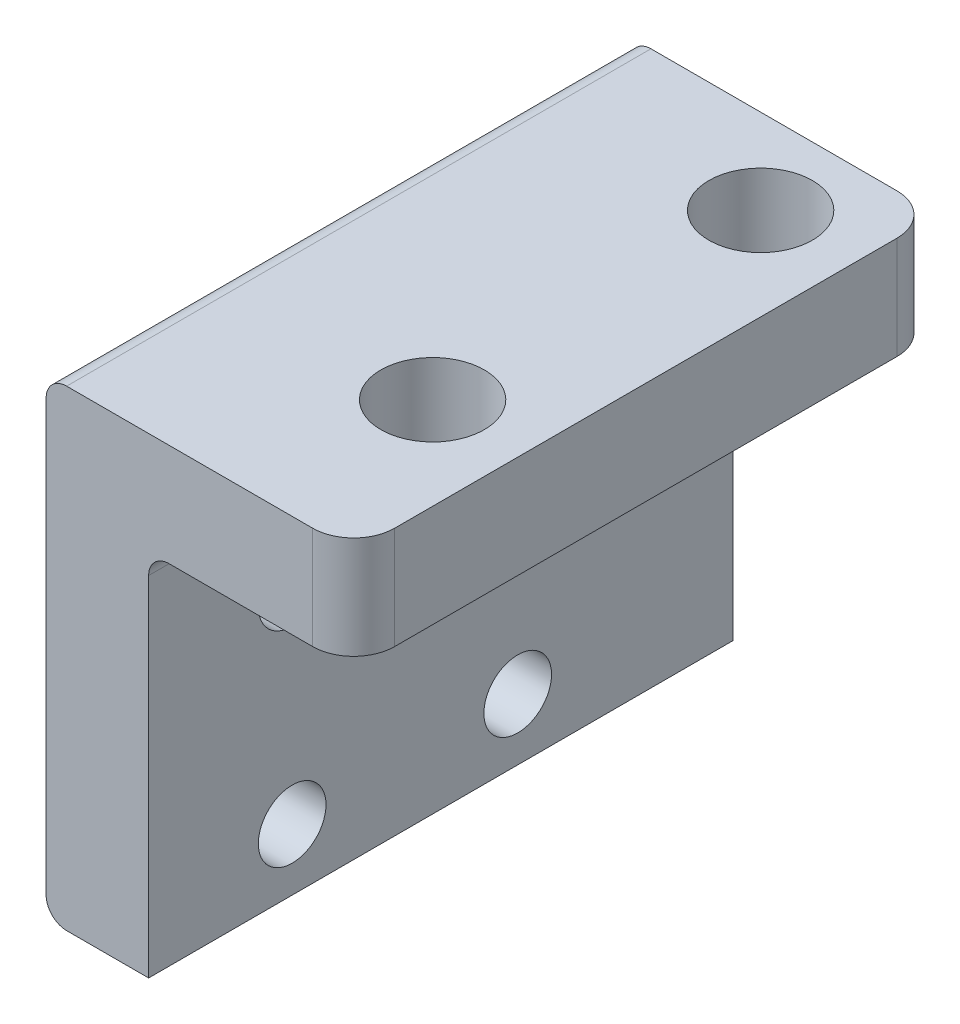
ISO-10303-21;
HEADER;
FILE_DESCRIPTION(('STEP AP214'),'2;1');
FILE_NAME('part.step','',(''),(''),'','','');
FILE_SCHEMA(('AUTOMOTIVE_DESIGN { 1 0 10303 214 1 1 1 1 }'));
ENDSEC;
DATA;
#1=APPLICATION_CONTEXT('core data for automotive mechanical design processes');
#2=APPLICATION_PROTOCOL_DEFINITION('international standard','automotive_design',2000,#1);
#3=PRODUCT_CONTEXT('',#1,'mechanical');
#4=PRODUCT('Part','Part','',(#3));
#5=PRODUCT_RELATED_PRODUCT_CATEGORY('part','',(#4));
#6=PRODUCT_DEFINITION_FORMATION('','',#4);
#7=PRODUCT_DEFINITION_CONTEXT('part definition',#1,'design');
#8=PRODUCT_DEFINITION('design','',#6,#7);
#9=PRODUCT_DEFINITION_SHAPE('','',#8);
#10=(LENGTH_UNIT() NAMED_UNIT(*) SI_UNIT(.MILLI.,.METRE.));
#11=(NAMED_UNIT(*) PLANE_ANGLE_UNIT() SI_UNIT($,.RADIAN.));
#12=(NAMED_UNIT(*) SI_UNIT($,.STERADIAN.) SOLID_ANGLE_UNIT());
#13=UNCERTAINTY_MEASURE_WITH_UNIT(LENGTH_MEASURE(1.E-05),#10,'distance_accuracy_value','');
#14=(GEOMETRIC_REPRESENTATION_CONTEXT(3) GLOBAL_UNCERTAINTY_ASSIGNED_CONTEXT((#13)) GLOBAL_UNIT_ASSIGNED_CONTEXT((#10,
#11,#12)) REPRESENTATION_CONTEXT('',''));
#15=CARTESIAN_POINT('',(0.,0.,0.));
#16=DIRECTION('',(0.,0.,1.));
#17=DIRECTION('',(1.,0.,0.));
#18=AXIS2_PLACEMENT_3D('',#15,#16,#17);
#19=CARTESIAN_POINT('',(0.,-18.,28.5));
#20=DIRECTION('',(-1.,0.,0.));
#21=DIRECTION('',(0.,-1.,0.));
#22=AXIS2_PLACEMENT_3D('',#19,#20,#21);
#23=PLANE('',#22);
#24=CARTESIAN_POINT('',(0.,-5.,21.5));
#25=DIRECTION('',(1.,0.,0.));
#26=DIRECTION('',(0.,0.,-1.));
#27=AXIS2_PLACEMENT_3D('',#24,#25,#26);
#28=CIRCLE('',#27,1.64999999999999);
#29=CARTESIAN_POINT('',(0.,-5.,19.85));
#30=VERTEX_POINT('',#29);
#31=EDGE_CURVE('E434',#30,#30,#28,.T.);
#32=ORIENTED_EDGE('',*,*,#31,.F.);
#33=EDGE_LOOP('',(#32));
#34=FACE_BOUND('',#33,.T.);
#35=CARTESIAN_POINT('',(0.,-15.,21.5));
#36=DIRECTION('',(1.,0.,0.));
#37=DIRECTION('',(0.,0.,-1.));
#38=AXIS2_PLACEMENT_3D('',#35,#36,#37);
#39=CIRCLE('',#38,1.64999999999999);
#40=CARTESIAN_POINT('',(0.,-15.,19.85));
#41=VERTEX_POINT('',#40);
#42=EDGE_CURVE('E440',#41,#41,#39,.T.);
#43=ORIENTED_EDGE('',*,*,#42,.F.);
#44=EDGE_LOOP('',(#43));
#45=FACE_BOUND('',#44,.T.);
#46=CARTESIAN_POINT('',(0.,-15.,10.5));
#47=DIRECTION('',(1.,0.,0.));
#48=DIRECTION('',(0.,0.,-1.));
#49=AXIS2_PLACEMENT_3D('',#46,#47,#48);
#50=CIRCLE('',#49,1.64999999999999);
#51=CARTESIAN_POINT('',(0.,-15.,8.85000000000002));
#52=VERTEX_POINT('',#51);
#53=EDGE_CURVE('E446',#52,#52,#50,.T.);
#54=ORIENTED_EDGE('',*,*,#53,.F.);
#55=EDGE_LOOP('',(#54));
#56=FACE_BOUND('',#55,.T.);
#57=CARTESIAN_POINT('',(0.,-5.,10.5));
#58=DIRECTION('',(1.,0.,0.));
#59=DIRECTION('',(0.,0.,-1.));
#60=AXIS2_PLACEMENT_3D('',#57,#58,#59);
#61=CIRCLE('',#60,1.64999999999999);
#62=CARTESIAN_POINT('',(0.,-5.,8.85000000000002));
#63=VERTEX_POINT('',#62);
#64=EDGE_CURVE('E451',#63,#63,#61,.T.);
#65=ORIENTED_EDGE('',*,*,#64,.F.);
#66=EDGE_LOOP('',(#65));
#67=FACE_BOUND('',#66,.T.);
#68=DIRECTION('',(0.,1.,0.));
#69=VECTOR('',#68,1.);
#70=CARTESIAN_POINT('',(0.,-18.,0.));
#71=LINE('',#70,#69);
#72=CARTESIAN_POINT('',(0.,-18.,0.));
#73=VERTEX_POINT('',#72);
#74=CARTESIAN_POINT('',(0.,-1.,0.));
#75=VERTEX_POINT('',#74);
#76=EDGE_CURVE('E160',#73,#75,#71,.T.);
#77=ORIENTED_EDGE('',*,*,#76,.T.);
#78=DIRECTION('',(0.,0.,-1.));
#79=VECTOR('',#78,1.);
#80=CARTESIAN_POINT('',(0.,-1.,28.5));
#81=LINE('',#80,#79);
#82=CARTESIAN_POINT('',(0.,-1.,28.5));
#83=VERTEX_POINT('',#82);
#84=EDGE_CURVE('E147',#75,#83,#81,.F.);
#85=ORIENTED_EDGE('',*,*,#84,.T.);
#86=DIRECTION('',(0.,1.,0.));
#87=VECTOR('',#86,1.);
#88=CARTESIAN_POINT('',(0.,-18.,28.5));
#89=LINE('',#88,#87);
#90=CARTESIAN_POINT('',(0.,-18.,28.5));
#91=VERTEX_POINT('',#90);
#92=EDGE_CURVE('E127',#91,#83,#89,.T.);
#93=ORIENTED_EDGE('',*,*,#92,.F.);
#94=DIRECTION('',(0.,0.,-1.));
#95=VECTOR('',#94,1.);
#96=CARTESIAN_POINT('',(0.,-18.,28.5));
#97=LINE('',#96,#95);
#98=EDGE_CURVE('E134',#91,#73,#97,.T.);
#99=ORIENTED_EDGE('',*,*,#98,.T.);
#100=EDGE_LOOP('',(#77,#85,#93,#99));
#101=FACE_BOUND('',#100,.T.);
#102=ADVANCED_FACE('F37',(#34,#45,#56,#67,#101),#23,.F.);
#103=CARTESIAN_POINT('',(0.,0.,28.5));
#104=DIRECTION('',(0.,1.,0.));
#105=DIRECTION('',(0.,0.,1.));
#106=AXIS2_PLACEMENT_3D('',#103,#104,#105);
#107=PLANE('',#106);
#108=CARTESIAN_POINT('',(5.5,0.,20.15));
#109=DIRECTION('',(0.,1.,0.));
#110=DIRECTION('',(0.,0.,1.));
#111=AXIS2_PLACEMENT_3D('',#108,#109,#110);
#112=CIRCLE('',#111,2.525);
#113=CARTESIAN_POINT('',(5.5,0.,22.675));
#114=VERTEX_POINT('',#113);
#115=EDGE_CURVE('E431',#114,#114,#112,.T.);
#116=ORIENTED_EDGE('',*,*,#115,.T.);
#117=EDGE_LOOP('',(#116));
#118=FACE_BOUND('',#117,.T.);
#119=CARTESIAN_POINT('',(5.5,0.,4.15));
#120=DIRECTION('',(0.,1.,0.));
#121=DIRECTION('',(0.,0.,1.));
#122=AXIS2_PLACEMENT_3D('',#119,#120,#121);
#123=CIRCLE('',#122,2.525);
#124=CARTESIAN_POINT('',(5.5,0.,6.675));
#125=VERTEX_POINT('',#124);
#126=EDGE_CURVE('E426',#125,#125,#123,.T.);
#127=ORIENTED_EDGE('',*,*,#126,.T.);
#128=EDGE_LOOP('',(#127));
#129=FACE_BOUND('',#128,.T.);
#130=DIRECTION('',(1.,0.,0.));
#131=VECTOR('',#130,1.);
#132=CARTESIAN_POINT('',(0.,0.,28.5));
#133=LINE('',#132,#131);
#134=CARTESIAN_POINT('',(1.,0.,28.5));
#135=VERTEX_POINT('',#134);
#136=CARTESIAN_POINT('',(8.,0.,28.5));
#137=VERTEX_POINT('',#136);
#138=EDGE_CURVE('E148',#135,#137,#133,.T.);
#139=ORIENTED_EDGE('',*,*,#138,.F.);
#140=DIRECTION('',(0.,0.,-1.));
#141=VECTOR('',#140,1.);
#142=CARTESIAN_POINT('',(1.,0.,0.));
#143=LINE('',#142,#141);
#144=CARTESIAN_POINT('',(1.,0.,0.));
#145=VERTEX_POINT('',#144);
#146=EDGE_CURVE('E192',#135,#145,#143,.T.);
#147=ORIENTED_EDGE('',*,*,#146,.T.);
#148=DIRECTION('',(1.,0.,0.));
#149=VECTOR('',#148,1.);
#150=CARTESIAN_POINT('',(0.,0.,0.));
#151=LINE('',#150,#149);
#152=CARTESIAN_POINT('',(8.,0.,0.));
#153=VERTEX_POINT('',#152);
#154=EDGE_CURVE('E162',#145,#153,#151,.T.);
#155=ORIENTED_EDGE('',*,*,#154,.T.);
#156=CARTESIAN_POINT('',(8.,0.,2.));
#157=DIRECTION('',(0.,1.,0.));
#158=DIRECTION('',(0.,0.,1.));
#159=AXIS2_PLACEMENT_3D('',#156,#157,#158);
#160=CIRCLE('',#159,2.);
#161=CARTESIAN_POINT('',(10.,0.,2.00000000000001));
#162=VERTEX_POINT('',#161);
#163=EDGE_CURVE('E187',#153,#162,#160,.F.);
#164=ORIENTED_EDGE('',*,*,#163,.T.);
#165=DIRECTION('',(0.,0.,-1.));
#166=VECTOR('',#165,1.);
#167=CARTESIAN_POINT('',(10.,0.,28.5));
#168=LINE('',#167,#166);
#169=CARTESIAN_POINT('',(10.,0.,26.5));
#170=VERTEX_POINT('',#169);
#171=EDGE_CURVE('E169',#170,#162,#168,.T.);
#172=ORIENTED_EDGE('',*,*,#171,.F.);
#173=CARTESIAN_POINT('',(8.,0.,26.5));
#174=DIRECTION('',(0.,1.,0.));
#175=DIRECTION('',(0.,0.,1.));
#176=AXIS2_PLACEMENT_3D('',#173,#174,#175);
#177=CIRCLE('',#176,2.);
#178=EDGE_CURVE('E184',#170,#137,#177,.F.);
#179=ORIENTED_EDGE('',*,*,#178,.T.);
#180=EDGE_LOOP('',(#139,#147,#155,#164,#172,#179));
#181=FACE_BOUND('',#180,.T.);
#182=ADVANCED_FACE('F217',(#118,#129,#181),#107,.F.);
#183=CARTESIAN_POINT('',(10.,0.,28.5));
#184=DIRECTION('',(-1.,0.,0.));
#185=DIRECTION('',(0.,-1.,0.));
#186=AXIS2_PLACEMENT_3D('',#183,#184,#185);
#187=PLANE('',#186);
#188=ORIENTED_EDGE('',*,*,#171,.T.);
#189=DIRECTION('',(0.,1.,0.));
#190=VECTOR('',#189,1.);
#191=CARTESIAN_POINT('',(10.,5.,2.));
#192=LINE('',#191,#190);
#193=CARTESIAN_POINT('',(10.,5.,2.00000000000001));
#194=VERTEX_POINT('',#193);
#195=EDGE_CURVE('E174',#162,#194,#192,.T.);
#196=ORIENTED_EDGE('',*,*,#195,.T.);
#197=DIRECTION('',(0.,0.,-1.));
#198=VECTOR('',#197,1.);
#199=CARTESIAN_POINT('',(10.,5.,28.5));
#200=LINE('',#199,#198);
#201=CARTESIAN_POINT('',(10.,5.,26.5));
#202=VERTEX_POINT('',#201);
#203=EDGE_CURVE('E144',#202,#194,#200,.T.);
#204=ORIENTED_EDGE('',*,*,#203,.F.);
#205=DIRECTION('',(0.,1.,0.));
#206=VECTOR('',#205,1.);
#207=CARTESIAN_POINT('',(10.,0.,26.5));
#208=LINE('',#207,#206);
#209=EDGE_CURVE('E172',#202,#170,#208,.F.);
#210=ORIENTED_EDGE('',*,*,#209,.T.);
#211=EDGE_LOOP('',(#188,#196,#204,#210));
#212=FACE_BOUND('',#211,.T.);
#213=ADVANCED_FACE('F228',(#212),#187,.F.);
#214=CARTESIAN_POINT('',(10.,5.,28.5));
#215=DIRECTION('',(0.,-1.,0.));
#216=DIRECTION('',(1.,0.,0.));
#217=AXIS2_PLACEMENT_3D('',#214,#215,#216);
#218=PLANE('',#217);
#219=CARTESIAN_POINT('',(5.5,5.,20.15));
#220=DIRECTION('',(0.,1.,0.));
#221=DIRECTION('',(-1.,0.,0.));
#222=AXIS2_PLACEMENT_3D('',#219,#220,#221);
#223=CIRCLE('',#222,2.525);
#224=CARTESIAN_POINT('',(2.97500000000001,5.,20.15));
#225=VERTEX_POINT('',#224);
#226=EDGE_CURVE('E422',#225,#225,#223,.T.);
#227=ORIENTED_EDGE('',*,*,#226,.F.);
#228=EDGE_LOOP('',(#227));
#229=FACE_BOUND('',#228,.T.);
#230=CARTESIAN_POINT('',(5.5,5.,4.15));
#231=DIRECTION('',(0.,1.,0.));
#232=DIRECTION('',(-1.,0.,0.));
#233=AXIS2_PLACEMENT_3D('',#230,#231,#232);
#234=CIRCLE('',#233,2.525);
#235=CARTESIAN_POINT('',(2.97500000000001,5.,4.15));
#236=VERTEX_POINT('',#235);
#237=EDGE_CURVE('E424',#236,#236,#234,.T.);
#238=ORIENTED_EDGE('',*,*,#237,.F.);
#239=EDGE_LOOP('',(#238));
#240=FACE_BOUND('',#239,.T.);
#241=DIRECTION('',(-1.,0.,0.));
#242=VECTOR('',#241,1.);
#243=CARTESIAN_POINT('',(10.,5.,0.));
#244=LINE('',#243,#242);
#245=CARTESIAN_POINT('',(8.,5.,0.));
#246=VERTEX_POINT('',#245);
#247=CARTESIAN_POINT('',(-3.99999999999999,5.,0.));
#248=VERTEX_POINT('',#247);
#249=EDGE_CURVE('E164',#246,#248,#244,.T.);
#250=ORIENTED_EDGE('',*,*,#249,.T.);
#251=DIRECTION('',(0.,0.,-1.));
#252=VECTOR('',#251,1.);
#253=CARTESIAN_POINT('',(-4.,5.,28.5));
#254=LINE('',#253,#252);
#255=CARTESIAN_POINT('',(-3.99999999999999,5.,28.5));
#256=VERTEX_POINT('',#255);
#257=EDGE_CURVE('E52',#248,#256,#254,.F.);
#258=ORIENTED_EDGE('',*,*,#257,.T.);
#259=DIRECTION('',(-1.,0.,0.));
#260=VECTOR('',#259,1.);
#261=CARTESIAN_POINT('',(10.,5.,28.5));
#262=LINE('',#261,#260);
#263=CARTESIAN_POINT('',(8.,5.,28.5));
#264=VERTEX_POINT('',#263);
#265=EDGE_CURVE('E150',#264,#256,#262,.T.);
#266=ORIENTED_EDGE('',*,*,#265,.F.);
#267=CARTESIAN_POINT('',(8.,5.,26.5));
#268=DIRECTION('',(0.,-1.,0.));
#269=DIRECTION('',(1.,0.,0.));
#270=AXIS2_PLACEMENT_3D('',#267,#268,#269);
#271=CIRCLE('',#270,2.);
#272=EDGE_CURVE('E177',#264,#202,#271,.F.);
#273=ORIENTED_EDGE('',*,*,#272,.T.);
#274=ORIENTED_EDGE('',*,*,#203,.T.);
#275=CARTESIAN_POINT('',(8.,5.,2.));
#276=DIRECTION('',(0.,-1.,0.));
#277=DIRECTION('',(1.,0.,0.));
#278=AXIS2_PLACEMENT_3D('',#275,#276,#277);
#279=CIRCLE('',#278,2.);
#280=EDGE_CURVE('E179',#194,#246,#279,.F.);
#281=ORIENTED_EDGE('',*,*,#280,.T.);
#282=EDGE_LOOP('',(#250,#258,#266,#273,#274,#281));
#283=FACE_BOUND('',#282,.T.);
#284=ADVANCED_FACE('F225',(#229,#240,#283),#218,.F.);
#285=CARTESIAN_POINT('',(-5.,5.,28.5));
#286=DIRECTION('',(1.,0.,0.));
#287=DIRECTION('',(0.,0.,-1.));
#288=AXIS2_PLACEMENT_3D('',#285,#286,#287);
#289=PLANE('',#288);
#290=CARTESIAN_POINT('',(-5.,-5.,21.5));
#291=DIRECTION('',(1.,0.,0.));
#292=DIRECTION('',(0.,0.,-1.));
#293=AXIS2_PLACEMENT_3D('',#290,#291,#292);
#294=CIRCLE('',#293,1.65);
#295=CARTESIAN_POINT('',(-5.,-5.,19.85));
#296=VERTEX_POINT('',#295);
#297=EDGE_CURVE('E437',#296,#296,#294,.T.);
#298=ORIENTED_EDGE('',*,*,#297,.T.);
#299=EDGE_LOOP('',(#298));
#300=FACE_BOUND('',#299,.T.);
#301=CARTESIAN_POINT('',(-5.,-15.,21.5));
#302=DIRECTION('',(1.,0.,0.));
#303=DIRECTION('',(0.,0.,-1.));
#304=AXIS2_PLACEMENT_3D('',#301,#302,#303);
#305=CIRCLE('',#304,1.65);
#306=CARTESIAN_POINT('',(-5.,-15.,19.85));
#307=VERTEX_POINT('',#306);
#308=EDGE_CURVE('E443',#307,#307,#305,.T.);
#309=ORIENTED_EDGE('',*,*,#308,.T.);
#310=EDGE_LOOP('',(#309));
#311=FACE_BOUND('',#310,.T.);
#312=CARTESIAN_POINT('',(-5.,-15.,10.5));
#313=DIRECTION('',(1.,0.,0.));
#314=DIRECTION('',(0.,0.,-1.));
#315=AXIS2_PLACEMENT_3D('',#312,#313,#314);
#316=CIRCLE('',#315,1.65);
#317=CARTESIAN_POINT('',(-5.,-15.,8.85000000000001));
#318=VERTEX_POINT('',#317);
#319=EDGE_CURVE('E449',#318,#318,#316,.T.);
#320=ORIENTED_EDGE('',*,*,#319,.T.);
#321=EDGE_LOOP('',(#320));
#322=FACE_BOUND('',#321,.T.);
#323=CARTESIAN_POINT('',(-5.,-5.,10.5));
#324=DIRECTION('',(1.,0.,0.));
#325=DIRECTION('',(0.,0.,-1.));
#326=AXIS2_PLACEMENT_3D('',#323,#324,#325);
#327=CIRCLE('',#326,1.65);
#328=CARTESIAN_POINT('',(-5.,-5.,8.85000000000001));
#329=VERTEX_POINT('',#328);
#330=EDGE_CURVE('E155',#329,#329,#327,.T.);
#331=ORIENTED_EDGE('',*,*,#330,.T.);
#332=EDGE_LOOP('',(#331));
#333=FACE_BOUND('',#332,.T.);
#334=DIRECTION('',(0.,-1.,0.));
#335=VECTOR('',#334,1.);
#336=CARTESIAN_POINT('',(-5.,5.,0.));
#337=LINE('',#336,#335);
#338=CARTESIAN_POINT('',(-5.,4.,0.));
#339=VERTEX_POINT('',#338);
#340=CARTESIAN_POINT('',(-5.,-17.,0.));
#341=VERTEX_POINT('',#340);
#342=EDGE_CURVE('E152',#339,#341,#337,.T.);
#343=ORIENTED_EDGE('',*,*,#342,.T.);
#344=DIRECTION('',(0.,0.,-1.));
#345=VECTOR('',#344,1.);
#346=CARTESIAN_POINT('',(-5.,-17.,28.5));
#347=LINE('',#346,#345);
#348=CARTESIAN_POINT('',(-5.,-17.,28.5));
#349=VERTEX_POINT('',#348);
#350=EDGE_CURVE('E60',#341,#349,#347,.F.);
#351=ORIENTED_EDGE('',*,*,#350,.T.);
#352=DIRECTION('',(0.,-1.,0.));
#353=VECTOR('',#352,1.);
#354=CARTESIAN_POINT('',(-5.,5.,28.5));
#355=LINE('',#354,#353);
#356=CARTESIAN_POINT('',(-5.,4.,28.5));
#357=VERTEX_POINT('',#356);
#358=EDGE_CURVE('E135',#357,#349,#355,.T.);
#359=ORIENTED_EDGE('',*,*,#358,.F.);
#360=DIRECTION('',(0.,0.,-1.));
#361=VECTOR('',#360,1.);
#362=CARTESIAN_POINT('',(-5.,4.,28.5));
#363=LINE('',#362,#361);
#364=EDGE_CURVE('E202',#357,#339,#363,.T.);
#365=ORIENTED_EDGE('',*,*,#364,.T.);
#366=EDGE_LOOP('',(#343,#351,#359,#365));
#367=FACE_BOUND('',#366,.T.);
#368=ADVANCED_FACE('F238',(#300,#311,#322,#333,#367),#289,.F.);
#369=CARTESIAN_POINT('',(-5.,-18.,28.5));
#370=DIRECTION('',(0.,1.,0.));
#371=DIRECTION('',(-1.,0.,0.));
#372=AXIS2_PLACEMENT_3D('',#369,#370,#371);
#373=PLANE('',#372);
#374=DIRECTION('',(1.,0.,0.));
#375=VECTOR('',#374,1.);
#376=CARTESIAN_POINT('',(-5.,-18.,28.5));
#377=LINE('',#376,#375);
#378=CARTESIAN_POINT('',(-4.,-18.,28.5));
#379=VERTEX_POINT('',#378);
#380=EDGE_CURVE('E123',#379,#91,#377,.T.);
#381=ORIENTED_EDGE('',*,*,#380,.F.);
#382=DIRECTION('',(0.,0.,-1.));
#383=VECTOR('',#382,1.);
#384=CARTESIAN_POINT('',(-4.,-18.,28.5));
#385=LINE('',#384,#383);
#386=CARTESIAN_POINT('',(-4.,-18.,0.));
#387=VERTEX_POINT('',#386);
#388=EDGE_CURVE('E196',#379,#387,#385,.T.);
#389=ORIENTED_EDGE('',*,*,#388,.T.);
#390=DIRECTION('',(1.,0.,0.));
#391=VECTOR('',#390,1.);
#392=CARTESIAN_POINT('',(-5.,-18.,0.));
#393=LINE('',#392,#391);
#394=EDGE_CURVE('E140',#387,#73,#393,.T.);
#395=ORIENTED_EDGE('',*,*,#394,.T.);
#396=ORIENTED_EDGE('',*,*,#98,.F.);
#397=EDGE_LOOP('',(#381,#389,#395,#396));
#398=FACE_BOUND('',#397,.T.);
#399=ADVANCED_FACE('F138',(#398),#373,.F.);
#400=CARTESIAN_POINT('',(0.,0.,28.5));
#401=DIRECTION('',(0.,0.,-1.));
#402=DIRECTION('',(-1.,0.,0.));
#403=AXIS2_PLACEMENT_3D('',#400,#401,#402);
#404=PLANE('',#403);
#405=ORIENTED_EDGE('',*,*,#358,.T.);
#406=CARTESIAN_POINT('',(-4.,-17.,28.5));
#407=DIRECTION('',(0.,0.,-1.));
#408=DIRECTION('',(-1.,0.,0.));
#409=AXIS2_PLACEMENT_3D('',#406,#407,#408);
#410=CIRCLE('',#409,1.);
#411=EDGE_CURVE('E130',#349,#379,#410,.F.);
#412=ORIENTED_EDGE('',*,*,#411,.T.);
#413=ORIENTED_EDGE('',*,*,#380,.T.);
#414=ORIENTED_EDGE('',*,*,#92,.T.);
#415=CARTESIAN_POINT('',(1.,-1.,28.5));
#416=DIRECTION('',(0.,0.,-1.));
#417=DIRECTION('',(-1.,0.,0.));
#418=AXIS2_PLACEMENT_3D('',#415,#416,#417);
#419=CIRCLE('',#418,1.);
#420=EDGE_CURVE('E11',#83,#135,#419,.T.);
#421=ORIENTED_EDGE('',*,*,#420,.T.);
#422=ORIENTED_EDGE('',*,*,#138,.T.);
#423=DIRECTION('',(0.,1.,0.));
#424=VECTOR('',#423,1.);
#425=CARTESIAN_POINT('',(8.,0.,28.5));
#426=LINE('',#425,#424);
#427=EDGE_CURVE('E189',#137,#264,#426,.T.);
#428=ORIENTED_EDGE('',*,*,#427,.T.);
#429=ORIENTED_EDGE('',*,*,#265,.T.);
#430=CARTESIAN_POINT('',(-4.,4.,28.5));
#431=DIRECTION('',(0.,0.,-1.));
#432=DIRECTION('',(-1.,0.,0.));
#433=AXIS2_PLACEMENT_3D('',#430,#431,#432);
#434=CIRCLE('',#433,1.);
#435=EDGE_CURVE('E206',#256,#357,#434,.F.);
#436=ORIENTED_EDGE('',*,*,#435,.T.);
#437=EDGE_LOOP('',(#405,#412,#413,#414,#421,#422,#428,#429,#436));
#438=FACE_BOUND('',#437,.T.);
#439=ADVANCED_FACE('F125',(#438),#404,.F.);
#440=CARTESIAN_POINT('',(0.,0.,0.));
#441=DIRECTION('',(0.,0.,-1.));
#442=DIRECTION('',(-1.,0.,0.));
#443=AXIS2_PLACEMENT_3D('',#440,#441,#442);
#444=PLANE('',#443);
#445=ORIENTED_EDGE('',*,*,#394,.F.);
#446=CARTESIAN_POINT('',(-4.,-17.,0.));
#447=DIRECTION('',(0.,0.,-1.));
#448=DIRECTION('',(-1.,0.,0.));
#449=AXIS2_PLACEMENT_3D('',#446,#447,#448);
#450=CIRCLE('',#449,1.);
#451=EDGE_CURVE('E200',#387,#341,#450,.T.);
#452=ORIENTED_EDGE('',*,*,#451,.T.);
#453=ORIENTED_EDGE('',*,*,#342,.F.);
#454=CARTESIAN_POINT('',(-4.,4.,0.));
#455=DIRECTION('',(0.,0.,-1.));
#456=DIRECTION('',(-1.,0.,0.));
#457=AXIS2_PLACEMENT_3D('',#454,#455,#456);
#458=CIRCLE('',#457,1.);
#459=EDGE_CURVE('E198',#339,#248,#458,.T.);
#460=ORIENTED_EDGE('',*,*,#459,.T.);
#461=ORIENTED_EDGE('',*,*,#249,.F.);
#462=DIRECTION('',(0.,1.,0.));
#463=VECTOR('',#462,1.);
#464=CARTESIAN_POINT('',(8.,0.,0.));
#465=LINE('',#464,#463);
#466=EDGE_CURVE('E181',#246,#153,#465,.F.);
#467=ORIENTED_EDGE('',*,*,#466,.T.);
#468=ORIENTED_EDGE('',*,*,#154,.F.);
#469=CARTESIAN_POINT('',(1.,-1.,0.));
#470=DIRECTION('',(0.,0.,-1.));
#471=DIRECTION('',(-1.,0.,0.));
#472=AXIS2_PLACEMENT_3D('',#469,#470,#471);
#473=CIRCLE('',#472,1.);
#474=EDGE_CURVE('E45',#145,#75,#473,.F.);
#475=ORIENTED_EDGE('',*,*,#474,.T.);
#476=ORIENTED_EDGE('',*,*,#76,.F.);
#477=EDGE_LOOP('',(#445,#452,#453,#460,#461,#467,#468,#475,#476));
#478=FACE_BOUND('',#477,.T.);
#479=ADVANCED_FACE('F211',(#478),#444,.T.);
#480=CARTESIAN_POINT('',(0.,-5.,10.5));
#481=DIRECTION('',(1.,0.,0.));
#482=DIRECTION('',(0.,0.,-1.));
#483=AXIS2_PLACEMENT_3D('',#480,#481,#482);
#484=CYLINDRICAL_SURFACE('',#483,1.64999999999999);
#485=ORIENTED_EDGE('',*,*,#330,.F.);
#486=EDGE_LOOP('',(#485));
#487=FACE_BOUND('',#486,.T.);
#488=ORIENTED_EDGE('',*,*,#64,.T.);
#489=EDGE_LOOP('',(#488));
#490=FACE_BOUND('',#489,.T.);
#491=ADVANCED_FACE('F288',(#487,#490),#484,.F.);
#492=CARTESIAN_POINT('',(0.,-15.,10.5));
#493=DIRECTION('',(1.,0.,0.));
#494=DIRECTION('',(0.,0.,-1.));
#495=AXIS2_PLACEMENT_3D('',#492,#493,#494);
#496=CYLINDRICAL_SURFACE('',#495,1.64999999999999);
#497=ORIENTED_EDGE('',*,*,#319,.F.);
#498=EDGE_LOOP('',(#497));
#499=FACE_BOUND('',#498,.T.);
#500=ORIENTED_EDGE('',*,*,#53,.T.);
#501=EDGE_LOOP('',(#500));
#502=FACE_BOUND('',#501,.T.);
#503=ADVANCED_FACE('F284',(#499,#502),#496,.F.);
#504=CARTESIAN_POINT('',(0.,-15.,21.5));
#505=DIRECTION('',(1.,0.,0.));
#506=DIRECTION('',(0.,0.,-1.));
#507=AXIS2_PLACEMENT_3D('',#504,#505,#506);
#508=CYLINDRICAL_SURFACE('',#507,1.64999999999999);
#509=ORIENTED_EDGE('',*,*,#308,.F.);
#510=EDGE_LOOP('',(#509));
#511=FACE_BOUND('',#510,.T.);
#512=ORIENTED_EDGE('',*,*,#42,.T.);
#513=EDGE_LOOP('',(#512));
#514=FACE_BOUND('',#513,.T.);
#515=ADVANCED_FACE('F280',(#511,#514),#508,.F.);
#516=CARTESIAN_POINT('',(0.,-5.,21.5));
#517=DIRECTION('',(1.,0.,0.));
#518=DIRECTION('',(0.,0.,-1.));
#519=AXIS2_PLACEMENT_3D('',#516,#517,#518);
#520=CYLINDRICAL_SURFACE('',#519,1.64999999999999);
#521=ORIENTED_EDGE('',*,*,#297,.F.);
#522=EDGE_LOOP('',(#521));
#523=FACE_BOUND('',#522,.T.);
#524=ORIENTED_EDGE('',*,*,#31,.T.);
#525=EDGE_LOOP('',(#524));
#526=FACE_BOUND('',#525,.T.);
#527=ADVANCED_FACE('F262',(#523,#526),#520,.F.);
#528=CARTESIAN_POINT('',(8.,0.,2.));
#529=DIRECTION('',(0.,-1.,0.));
#530=DIRECTION('',(1.,0.,0.));
#531=AXIS2_PLACEMENT_3D('',#528,#529,#530);
#532=CYLINDRICAL_SURFACE('',#531,2.);
#533=ORIENTED_EDGE('',*,*,#163,.F.);
#534=ORIENTED_EDGE('',*,*,#466,.F.);
#535=ORIENTED_EDGE('',*,*,#280,.F.);
#536=ORIENTED_EDGE('',*,*,#195,.F.);
#537=EDGE_LOOP('',(#533,#534,#535,#536));
#538=FACE_BOUND('',#537,.T.);
#539=ADVANCED_FACE('F232',(#538),#532,.T.);
#540=CARTESIAN_POINT('',(8.,0.,26.5));
#541=DIRECTION('',(0.,1.,0.));
#542=DIRECTION('',(-1.,0.,0.));
#543=AXIS2_PLACEMENT_3D('',#540,#541,#542);
#544=CYLINDRICAL_SURFACE('',#543,2.);
#545=ORIENTED_EDGE('',*,*,#178,.F.);
#546=ORIENTED_EDGE('',*,*,#209,.F.);
#547=ORIENTED_EDGE('',*,*,#272,.F.);
#548=ORIENTED_EDGE('',*,*,#427,.F.);
#549=EDGE_LOOP('',(#545,#546,#547,#548));
#550=FACE_BOUND('',#549,.T.);
#551=ADVANCED_FACE('F223',(#550),#544,.T.);
#552=CARTESIAN_POINT('',(5.5,-5.,4.15));
#553=DIRECTION('',(0.,1.,0.));
#554=DIRECTION('',(-1.,0.,0.));
#555=AXIS2_PLACEMENT_3D('',#552,#553,#554);
#556=CYLINDRICAL_SURFACE('',#555,2.525);
#557=ORIENTED_EDGE('',*,*,#237,.T.);
#558=EDGE_LOOP('',(#557));
#559=FACE_BOUND('',#558,.T.);
#560=ORIENTED_EDGE('',*,*,#126,.F.);
#561=EDGE_LOOP('',(#560));
#562=FACE_BOUND('',#561,.T.);
#563=ADVANCED_FACE('F264',(#559,#562),#556,.F.);
#564=CARTESIAN_POINT('',(5.5,-5.,20.15));
#565=DIRECTION('',(0.,1.,0.));
#566=DIRECTION('',(-1.,0.,0.));
#567=AXIS2_PLACEMENT_3D('',#564,#565,#566);
#568=CYLINDRICAL_SURFACE('',#567,2.525);
#569=ORIENTED_EDGE('',*,*,#226,.T.);
#570=EDGE_LOOP('',(#569));
#571=FACE_BOUND('',#570,.T.);
#572=ORIENTED_EDGE('',*,*,#115,.F.);
#573=EDGE_LOOP('',(#572));
#574=FACE_BOUND('',#573,.T.);
#575=ADVANCED_FACE('F246',(#571,#574),#568,.F.);
#576=CARTESIAN_POINT('',(1.,-1.,28.5));
#577=DIRECTION('',(0.,0.,1.));
#578=DIRECTION('',(1.,0.,0.));
#579=AXIS2_PLACEMENT_3D('',#576,#577,#578);
#580=CYLINDRICAL_SURFACE('',#579,1.);
#581=ORIENTED_EDGE('',*,*,#420,.F.);
#582=ORIENTED_EDGE('',*,*,#84,.F.);
#583=ORIENTED_EDGE('',*,*,#474,.F.);
#584=ORIENTED_EDGE('',*,*,#146,.F.);
#585=EDGE_LOOP('',(#581,#582,#583,#584));
#586=FACE_BOUND('',#585,.T.);
#587=ADVANCED_FACE('F214',(#586),#580,.F.);
#588=CARTESIAN_POINT('',(-4.,-17.,28.5));
#589=DIRECTION('',(0.,0.,-1.));
#590=DIRECTION('',(-1.,0.,0.));
#591=AXIS2_PLACEMENT_3D('',#588,#589,#590);
#592=CYLINDRICAL_SURFACE('',#591,1.);
#593=ORIENTED_EDGE('',*,*,#411,.F.);
#594=ORIENTED_EDGE('',*,*,#350,.F.);
#595=ORIENTED_EDGE('',*,*,#451,.F.);
#596=ORIENTED_EDGE('',*,*,#388,.F.);
#597=EDGE_LOOP('',(#593,#594,#595,#596));
#598=FACE_BOUND('',#597,.T.);
#599=ADVANCED_FACE('F240',(#598),#592,.T.);
#600=CARTESIAN_POINT('',(-4.,4.,28.5));
#601=DIRECTION('',(0.,0.,-1.));
#602=DIRECTION('',(-1.,0.,0.));
#603=AXIS2_PLACEMENT_3D('',#600,#601,#602);
#604=CYLINDRICAL_SURFACE('',#603,1.);
#605=ORIENTED_EDGE('',*,*,#435,.F.);
#606=ORIENTED_EDGE('',*,*,#257,.F.);
#607=ORIENTED_EDGE('',*,*,#459,.F.);
#608=ORIENTED_EDGE('',*,*,#364,.F.);
#609=EDGE_LOOP('',(#605,#606,#607,#608));
#610=FACE_BOUND('',#609,.T.);
#611=ADVANCED_FACE('F39',(#610),#604,.T.);
#612=CLOSED_SHELL('',(#102,#182,#213,#284,#368,#399,#439,#479,#491,#503,#515,#527,#539,#551,
#563,#575,#587,#599,#611));
#613=MANIFOLD_SOLID_BREP('B2',#612);
#614=ADVANCED_BREP_SHAPE_REPRESENTATION('',(#18,#613),#14);
#615=SHAPE_DEFINITION_REPRESENTATION(#9,#614);
ENDSEC;
END-ISO-10303-21;
